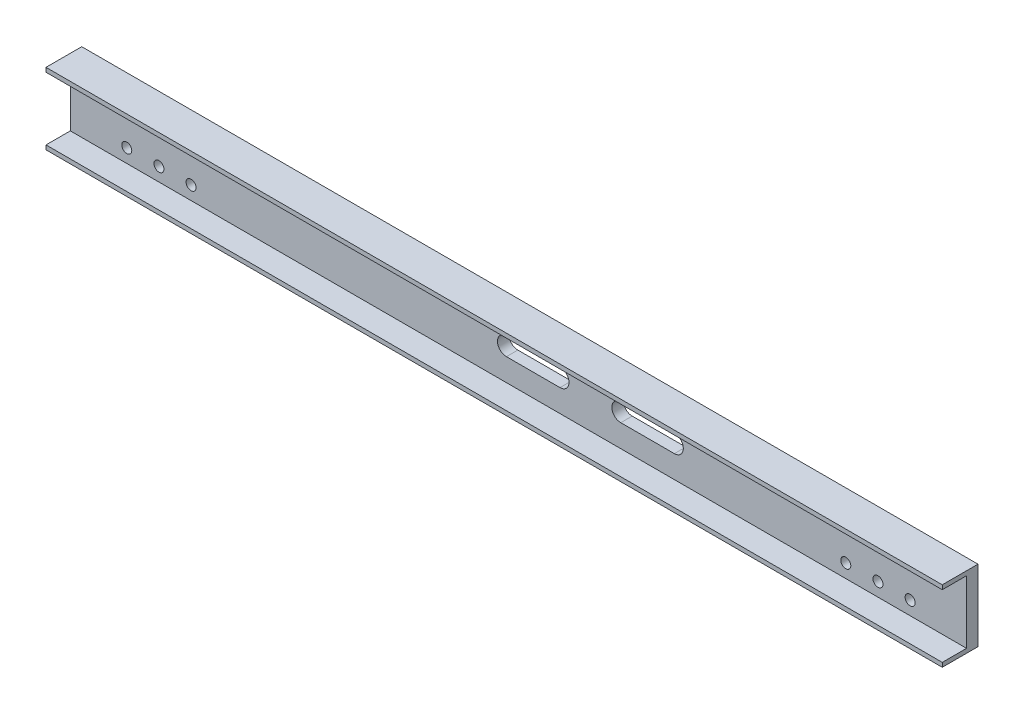
ISO-10303-21;
HEADER;
FILE_DESCRIPTION(('STEP AP214'),'2;1');
FILE_NAME('part.step','',(''),(''),'','','');
FILE_SCHEMA(('AUTOMOTIVE_DESIGN { 1 0 10303 214 1 1 1 1 }'));
ENDSEC;
DATA;
#1=APPLICATION_CONTEXT('core data for automotive mechanical design processes');
#2=APPLICATION_PROTOCOL_DEFINITION('international standard','automotive_design',2000,#1);
#3=PRODUCT_CONTEXT('',#1,'mechanical');
#4=PRODUCT('Part','Part','',(#3));
#5=PRODUCT_RELATED_PRODUCT_CATEGORY('part','',(#4));
#6=PRODUCT_DEFINITION_FORMATION('','',#4);
#7=PRODUCT_DEFINITION_CONTEXT('part definition',#1,'design');
#8=PRODUCT_DEFINITION('design','',#6,#7);
#9=PRODUCT_DEFINITION_SHAPE('','',#8);
#10=(LENGTH_UNIT() NAMED_UNIT(*) SI_UNIT(.MILLI.,.METRE.));
#11=(NAMED_UNIT(*) PLANE_ANGLE_UNIT() SI_UNIT($,.RADIAN.));
#12=(NAMED_UNIT(*) SI_UNIT($,.STERADIAN.) SOLID_ANGLE_UNIT());
#13=UNCERTAINTY_MEASURE_WITH_UNIT(LENGTH_MEASURE(1.E-05),#10,'distance_accuracy_value','');
#14=(GEOMETRIC_REPRESENTATION_CONTEXT(3) GLOBAL_UNCERTAINTY_ASSIGNED_CONTEXT((#13)) GLOBAL_UNIT_ASSIGNED_CONTEXT((#10,
#11,#12)) REPRESENTATION_CONTEXT('',''));
#15=CARTESIAN_POINT('',(0.,0.,0.));
#16=DIRECTION('',(0.,0.,1.));
#17=DIRECTION('',(1.,0.,0.));
#18=AXIS2_PLACEMENT_3D('',#15,#16,#17);
#19=CARTESIAN_POINT('',(1254.,50.,0.));
#20=DIRECTION('',(0.,-1.,0.));
#21=DIRECTION('',(0.,0.,-1.));
#22=AXIS2_PLACEMENT_3D('',#19,#20,#21);
#23=PLANE('',#22);
#24=DIRECTION('',(0.,0.,1.));
#25=VECTOR('',#24,1.);
#26=CARTESIAN_POINT('',(0.,50.,0.));
#27=LINE('',#26,#25);
#28=CARTESIAN_POINT('',(0.,50.,-8.));
#29=VERTEX_POINT('',#28);
#30=CARTESIAN_POINT('',(0.,50.,42.));
#31=VERTEX_POINT('',#30);
#32=EDGE_CURVE('E343',#29,#31,#27,.T.);
#33=ORIENTED_EDGE('',*,*,#32,.T.);
#34=DIRECTION('',(-1.,0.,0.));
#35=VECTOR('',#34,1.);
#36=CARTESIAN_POINT('',(1254.,50.,42.));
#37=LINE('',#36,#35);
#38=CARTESIAN_POINT('',(1254.,50.,42.));
#39=VERTEX_POINT('',#38);
#40=EDGE_CURVE('E11',#39,#31,#37,.T.);
#41=ORIENTED_EDGE('',*,*,#40,.F.);
#42=DIRECTION('',(0.,0.,1.));
#43=VECTOR('',#42,1.);
#44=CARTESIAN_POINT('',(1254.,50.,0.));
#45=LINE('',#44,#43);
#46=CARTESIAN_POINT('',(1254.,50.,-8.));
#47=VERTEX_POINT('',#46);
#48=EDGE_CURVE('E344',#47,#39,#45,.T.);
#49=ORIENTED_EDGE('',*,*,#48,.F.);
#50=DIRECTION('',(-1.,0.,0.));
#51=VECTOR('',#50,1.);
#52=CARTESIAN_POINT('',(1254.,50.,-8.));
#53=LINE('',#52,#51);
#54=EDGE_CURVE('E373',#47,#29,#53,.T.);
#55=ORIENTED_EDGE('',*,*,#54,.T.);
#56=EDGE_LOOP('',(#33,#41,#49,#55));
#57=FACE_BOUND('',#56,.T.);
#58=ADVANCED_FACE('F41',(#57),#23,.F.);
#59=CARTESIAN_POINT('',(1254.,0.,42.));
#60=DIRECTION('',(0.,0.,-1.));
#61=DIRECTION('',(0.,1.,0.));
#62=AXIS2_PLACEMENT_3D('',#59,#60,#61);
#63=PLANE('',#62);
#64=DIRECTION('',(0.,-1.,0.));
#65=VECTOR('',#64,1.);
#66=CARTESIAN_POINT('',(0.,0.,42.));
#67=LINE('',#66,#65);
#68=CARTESIAN_POINT('',(0.,44.,42.));
#69=VERTEX_POINT('',#68);
#70=EDGE_CURVE('E377',#31,#69,#67,.T.);
#71=ORIENTED_EDGE('',*,*,#70,.T.);
#72=DIRECTION('',(-1.,0.,0.));
#73=VECTOR('',#72,1.);
#74=CARTESIAN_POINT('',(1254.,44.,42.));
#75=LINE('',#74,#73);
#76=CARTESIAN_POINT('',(1254.,44.,42.));
#77=VERTEX_POINT('',#76);
#78=EDGE_CURVE('E49',#77,#69,#75,.T.);
#79=ORIENTED_EDGE('',*,*,#78,.F.);
#80=DIRECTION('',(0.,-1.,0.));
#81=VECTOR('',#80,1.);
#82=CARTESIAN_POINT('',(1254.,0.,42.));
#83=LINE('',#82,#81);
#84=EDGE_CURVE('E348',#39,#77,#83,.T.);
#85=ORIENTED_EDGE('',*,*,#84,.F.);
#86=ORIENTED_EDGE('',*,*,#40,.T.);
#87=EDGE_LOOP('',(#71,#79,#85,#86));
#88=FACE_BOUND('',#87,.T.);
#89=ADVANCED_FACE('F427',(#88),#63,.F.);
#90=CARTESIAN_POINT('',(1254.,44.,0.));
#91=DIRECTION('',(0.,-1.,0.));
#92=DIRECTION('',(0.,0.,-1.));
#93=AXIS2_PLACEMENT_3D('',#90,#91,#92);
#94=PLANE('',#93);
#95=DIRECTION('',(0.,0.,1.));
#96=VECTOR('',#95,1.);
#97=CARTESIAN_POINT('',(0.,44.,0.));
#98=LINE('',#97,#96);
#99=CARTESIAN_POINT('',(0.,44.,8.));
#100=VERTEX_POINT('',#99);
#101=EDGE_CURVE('E381',#100,#69,#98,.T.);
#102=ORIENTED_EDGE('',*,*,#101,.F.);
#103=DIRECTION('',(-1.,0.,0.));
#104=VECTOR('',#103,1.);
#105=CARTESIAN_POINT('',(1254.,44.,8.));
#106=LINE('',#105,#104);
#107=CARTESIAN_POINT('',(1254.,44.,8.));
#108=VERTEX_POINT('',#107);
#109=EDGE_CURVE('E418',#108,#100,#106,.T.);
#110=ORIENTED_EDGE('',*,*,#109,.F.);
#111=DIRECTION('',(0.,0.,1.));
#112=VECTOR('',#111,1.);
#113=CARTESIAN_POINT('',(1254.,44.,0.));
#114=LINE('',#113,#112);
#115=EDGE_CURVE('E352',#108,#77,#114,.T.);
#116=ORIENTED_EDGE('',*,*,#115,.T.);
#117=ORIENTED_EDGE('',*,*,#78,.T.);
#118=EDGE_LOOP('',(#102,#110,#116,#117));
#119=FACE_BOUND('',#118,.T.);
#120=ADVANCED_FACE('F424',(#119),#94,.T.);
#121=CARTESIAN_POINT('',(1254.,0.,8.));
#122=DIRECTION('',(0.,0.,1.));
#123=DIRECTION('',(1.,0.,0.));
#124=AXIS2_PLACEMENT_3D('',#121,#122,#123);
#125=PLANE('',#124);
#126=CARTESIAN_POINT('',(770.18,0.,8.));
#127=DIRECTION('',(0.,0.,1.));
#128=DIRECTION('',(1.,0.,0.));
#129=AXIS2_PLACEMENT_3D('',#126,#127,#128);
#130=CIRCLE('',#129,12.5);
#131=CARTESIAN_POINT('',(770.18,12.5,8.));
#132=VERTEX_POINT('',#131);
#133=CARTESIAN_POINT('',(770.18,-12.5,8.));
#134=VERTEX_POINT('',#133);
#135=EDGE_CURVE('E159',#132,#134,#130,.T.);
#136=ORIENTED_EDGE('',*,*,#135,.F.);
#137=DIRECTION('',(-1.,0.,0.));
#138=VECTOR('',#137,1.);
#139=CARTESIAN_POINT('',(1254.,12.5000000000001,8.));
#140=LINE('',#139,#138);
#141=CARTESIAN_POINT('',(845.18,12.5,8.));
#142=VERTEX_POINT('',#141);
#143=EDGE_CURVE('E242',#142,#132,#140,.T.);
#144=ORIENTED_EDGE('',*,*,#143,.F.);
#145=CARTESIAN_POINT('',(845.18,0.,8.));
#146=DIRECTION('',(0.,0.,1.));
#147=DIRECTION('',(1.,0.,0.));
#148=AXIS2_PLACEMENT_3D('',#145,#146,#147);
#149=CIRCLE('',#148,12.5);
#150=CARTESIAN_POINT('',(845.18,-12.5,8.));
#151=VERTEX_POINT('',#150);
#152=EDGE_CURVE('E239',#151,#142,#149,.T.);
#153=ORIENTED_EDGE('',*,*,#152,.F.);
#154=DIRECTION('',(1.,0.,0.));
#155=VECTOR('',#154,1.);
#156=CARTESIAN_POINT('',(1254.,-12.4999999999999,8.));
#157=LINE('',#156,#155);
#158=EDGE_CURVE('E236',#134,#151,#157,.T.);
#159=ORIENTED_EDGE('',*,*,#158,.F.);
#160=EDGE_LOOP('',(#136,#144,#153,#159));
#161=FACE_BOUND('',#160,.T.);
#162=CARTESIAN_POINT('',(685.18,0.,8.));
#163=DIRECTION('',(0.,0.,1.));
#164=DIRECTION('',(1.,0.,0.));
#165=AXIS2_PLACEMENT_3D('',#162,#163,#164);
#166=CIRCLE('',#165,12.5);
#167=CARTESIAN_POINT('',(685.18,-12.5,8.));
#168=VERTEX_POINT('',#167);
#169=CARTESIAN_POINT('',(685.18,12.5,8.));
#170=VERTEX_POINT('',#169);
#171=EDGE_CURVE('E233',#168,#170,#166,.T.);
#172=ORIENTED_EDGE('',*,*,#171,.F.);
#173=DIRECTION('',(1.,0.,0.));
#174=VECTOR('',#173,1.);
#175=CARTESIAN_POINT('',(1254.,-12.4999999999999,8.));
#176=LINE('',#175,#174);
#177=CARTESIAN_POINT('',(610.18,-12.5,8.));
#178=VERTEX_POINT('',#177);
#179=EDGE_CURVE('E230',#178,#168,#176,.T.);
#180=ORIENTED_EDGE('',*,*,#179,.F.);
#181=CARTESIAN_POINT('',(610.18,0.,8.));
#182=DIRECTION('',(0.,0.,1.));
#183=DIRECTION('',(1.,0.,0.));
#184=AXIS2_PLACEMENT_3D('',#181,#182,#183);
#185=CIRCLE('',#184,12.5);
#186=CARTESIAN_POINT('',(610.18,12.5,8.));
#187=VERTEX_POINT('',#186);
#188=EDGE_CURVE('E227',#187,#178,#185,.T.);
#189=ORIENTED_EDGE('',*,*,#188,.F.);
#190=DIRECTION('',(-1.,0.,0.));
#191=VECTOR('',#190,1.);
#192=CARTESIAN_POINT('',(1254.,12.5000000000001,8.));
#193=LINE('',#192,#191);
#194=EDGE_CURVE('E193',#170,#187,#193,.T.);
#195=ORIENTED_EDGE('',*,*,#194,.F.);
#196=EDGE_LOOP('',(#172,#180,#189,#195));
#197=FACE_BOUND('',#196,.T.);
#198=CARTESIAN_POINT('',(1175.,25.,8.));
#199=DIRECTION('',(0.,0.,1.));
#200=DIRECTION('',(1.,0.,0.));
#201=AXIS2_PLACEMENT_3D('',#198,#199,#200);
#202=CIRCLE('',#201,6.9999999999999);
#203=CARTESIAN_POINT('',(1182.,25.,8.));
#204=VERTEX_POINT('',#203);
#205=EDGE_CURVE('E247',#204,#204,#202,.T.);
#206=ORIENTED_EDGE('',*,*,#205,.F.);
#207=EDGE_LOOP('',(#206));
#208=FACE_BOUND('',#207,.T.);
#209=CARTESIAN_POINT('',(1130.,25.,8.));
#210=DIRECTION('',(0.,0.,1.));
#211=DIRECTION('',(1.,0.,0.));
#212=AXIS2_PLACEMENT_3D('',#209,#210,#211);
#213=CIRCLE('',#212,6.9999999999999);
#214=CARTESIAN_POINT('',(1137.,25.,8.));
#215=VERTEX_POINT('',#214);
#216=EDGE_CURVE('E255',#215,#215,#213,.T.);
#217=ORIENTED_EDGE('',*,*,#216,.F.);
#218=EDGE_LOOP('',(#217));
#219=FACE_BOUND('',#218,.T.);
#220=CARTESIAN_POINT('',(1085.,25.,8.));
#221=DIRECTION('',(0.,0.,1.));
#222=DIRECTION('',(1.,0.,0.));
#223=AXIS2_PLACEMENT_3D('',#220,#221,#222);
#224=CIRCLE('',#223,6.9999999999999);
#225=CARTESIAN_POINT('',(1092.,25.,8.));
#226=VERTEX_POINT('',#225);
#227=EDGE_CURVE('E263',#226,#226,#224,.T.);
#228=ORIENTED_EDGE('',*,*,#227,.F.);
#229=EDGE_LOOP('',(#228));
#230=FACE_BOUND('',#229,.T.);
#231=CARTESIAN_POINT('',(1085.,-25.,8.));
#232=DIRECTION('',(0.,0.,1.));
#233=DIRECTION('',(1.,0.,0.));
#234=AXIS2_PLACEMENT_3D('',#231,#232,#233);
#235=CIRCLE('',#234,6.9999999999999);
#236=CARTESIAN_POINT('',(1092.,-25.,8.));
#237=VERTEX_POINT('',#236);
#238=EDGE_CURVE('E271',#237,#237,#235,.T.);
#239=ORIENTED_EDGE('',*,*,#238,.F.);
#240=EDGE_LOOP('',(#239));
#241=FACE_BOUND('',#240,.T.);
#242=CARTESIAN_POINT('',(1130.,-25.,8.));
#243=DIRECTION('',(0.,0.,1.));
#244=DIRECTION('',(1.,0.,0.));
#245=AXIS2_PLACEMENT_3D('',#242,#243,#244);
#246=CIRCLE('',#245,6.9999999999999);
#247=CARTESIAN_POINT('',(1137.,-25.,8.));
#248=VERTEX_POINT('',#247);
#249=EDGE_CURVE('E279',#248,#248,#246,.T.);
#250=ORIENTED_EDGE('',*,*,#249,.F.);
#251=EDGE_LOOP('',(#250));
#252=FACE_BOUND('',#251,.T.);
#253=CARTESIAN_POINT('',(1175.,-25.,8.));
#254=DIRECTION('',(0.,0.,1.));
#255=DIRECTION('',(1.,0.,0.));
#256=AXIS2_PLACEMENT_3D('',#253,#254,#255);
#257=CIRCLE('',#256,6.9999999999999);
#258=CARTESIAN_POINT('',(1182.,-25.,8.));
#259=VERTEX_POINT('',#258);
#260=EDGE_CURVE('E287',#259,#259,#257,.T.);
#261=ORIENTED_EDGE('',*,*,#260,.F.);
#262=EDGE_LOOP('',(#261));
#263=FACE_BOUND('',#262,.T.);
#264=CARTESIAN_POINT('',(79.,25.,8.));
#265=DIRECTION('',(0.,0.,1.));
#266=DIRECTION('',(1.,0.,0.));
#267=AXIS2_PLACEMENT_3D('',#264,#265,#266);
#268=CIRCLE('',#267,6.99999999999999);
#269=CARTESIAN_POINT('',(86.,25.,8.));
#270=VERTEX_POINT('',#269);
#271=EDGE_CURVE('E295',#270,#270,#268,.T.);
#272=ORIENTED_EDGE('',*,*,#271,.F.);
#273=EDGE_LOOP('',(#272));
#274=FACE_BOUND('',#273,.T.);
#275=CARTESIAN_POINT('',(124.,25.,8.));
#276=DIRECTION('',(0.,0.,1.));
#277=DIRECTION('',(1.,0.,0.));
#278=AXIS2_PLACEMENT_3D('',#275,#276,#277);
#279=CIRCLE('',#278,7.00000000000001);
#280=CARTESIAN_POINT('',(131.,25.,8.));
#281=VERTEX_POINT('',#280);
#282=EDGE_CURVE('E303',#281,#281,#279,.T.);
#283=ORIENTED_EDGE('',*,*,#282,.F.);
#284=EDGE_LOOP('',(#283));
#285=FACE_BOUND('',#284,.T.);
#286=CARTESIAN_POINT('',(169.,25.,8.));
#287=DIRECTION('',(0.,0.,1.));
#288=DIRECTION('',(1.,0.,0.));
#289=AXIS2_PLACEMENT_3D('',#286,#287,#288);
#290=CIRCLE('',#289,7.00000000000001);
#291=CARTESIAN_POINT('',(176.,25.,8.));
#292=VERTEX_POINT('',#291);
#293=EDGE_CURVE('E311',#292,#292,#290,.T.);
#294=ORIENTED_EDGE('',*,*,#293,.F.);
#295=EDGE_LOOP('',(#294));
#296=FACE_BOUND('',#295,.T.);
#297=CARTESIAN_POINT('',(169.,-25.,8.));
#298=DIRECTION('',(0.,0.,1.));
#299=DIRECTION('',(1.,0.,0.));
#300=AXIS2_PLACEMENT_3D('',#297,#298,#299);
#301=CIRCLE('',#300,7.00000000000001);
#302=CARTESIAN_POINT('',(176.,-25.,8.));
#303=VERTEX_POINT('',#302);
#304=EDGE_CURVE('E319',#303,#303,#301,.T.);
#305=ORIENTED_EDGE('',*,*,#304,.F.);
#306=EDGE_LOOP('',(#305));
#307=FACE_BOUND('',#306,.T.);
#308=CARTESIAN_POINT('',(124.,-25.,8.));
#309=DIRECTION('',(0.,0.,1.));
#310=DIRECTION('',(1.,0.,0.));
#311=AXIS2_PLACEMENT_3D('',#308,#309,#310);
#312=CIRCLE('',#311,7.00000000000001);
#313=CARTESIAN_POINT('',(131.,-25.,8.));
#314=VERTEX_POINT('',#313);
#315=EDGE_CURVE('E327',#314,#314,#312,.T.);
#316=ORIENTED_EDGE('',*,*,#315,.F.);
#317=EDGE_LOOP('',(#316));
#318=FACE_BOUND('',#317,.T.);
#319=CARTESIAN_POINT('',(79.,-25.,8.));
#320=DIRECTION('',(0.,0.,1.));
#321=DIRECTION('',(1.,0.,0.));
#322=AXIS2_PLACEMENT_3D('',#319,#320,#321);
#323=CIRCLE('',#322,6.99999999999999);
#324=CARTESIAN_POINT('',(86.,-25.,8.));
#325=VERTEX_POINT('',#324);
#326=EDGE_CURVE('E335',#325,#325,#323,.T.);
#327=ORIENTED_EDGE('',*,*,#326,.F.);
#328=EDGE_LOOP('',(#327));
#329=FACE_BOUND('',#328,.T.);
#330=DIRECTION('',(0.,1.,0.));
#331=VECTOR('',#330,1.);
#332=CARTESIAN_POINT('',(0.,0.,8.));
#333=LINE('',#332,#331);
#334=CARTESIAN_POINT('',(0.,-44.,8.));
#335=VERTEX_POINT('',#334);
#336=EDGE_CURVE('E385',#335,#100,#333,.T.);
#337=ORIENTED_EDGE('',*,*,#336,.F.);
#338=DIRECTION('',(-1.,0.,0.));
#339=VECTOR('',#338,1.);
#340=CARTESIAN_POINT('',(1254.,-44.,8.));
#341=LINE('',#340,#339);
#342=CARTESIAN_POINT('',(1254.,-44.,8.));
#343=VERTEX_POINT('',#342);
#344=EDGE_CURVE('E415',#343,#335,#341,.T.);
#345=ORIENTED_EDGE('',*,*,#344,.F.);
#346=DIRECTION('',(0.,1.,0.));
#347=VECTOR('',#346,1.);
#348=CARTESIAN_POINT('',(1254.,0.,8.));
#349=LINE('',#348,#347);
#350=EDGE_CURVE('E356',#343,#108,#349,.T.);
#351=ORIENTED_EDGE('',*,*,#350,.T.);
#352=ORIENTED_EDGE('',*,*,#109,.T.);
#353=EDGE_LOOP('',(#337,#345,#351,#352));
#354=FACE_BOUND('',#353,.T.);
#355=ADVANCED_FACE('F435',(#161,#197,#208,#219,#230,#241,#252,#263,#274,#285,#296,#307,#318,
#329,#354),#125,.T.);
#356=CARTESIAN_POINT('',(1254.,-44.,0.));
#357=DIRECTION('',(0.,-1.,0.));
#358=DIRECTION('',(0.,0.,-1.));
#359=AXIS2_PLACEMENT_3D('',#356,#357,#358);
#360=PLANE('',#359);
#361=DIRECTION('',(0.,0.,1.));
#362=VECTOR('',#361,1.);
#363=CARTESIAN_POINT('',(0.,-44.,0.));
#364=LINE('',#363,#362);
#365=CARTESIAN_POINT('',(0.,-44.,42.));
#366=VERTEX_POINT('',#365);
#367=EDGE_CURVE('E389',#335,#366,#364,.T.);
#368=ORIENTED_EDGE('',*,*,#367,.T.);
#369=DIRECTION('',(-1.,0.,0.));
#370=VECTOR('',#369,1.);
#371=CARTESIAN_POINT('',(1254.,-44.,42.));
#372=LINE('',#371,#370);
#373=CARTESIAN_POINT('',(1254.,-44.,42.));
#374=VERTEX_POINT('',#373);
#375=EDGE_CURVE('E412',#374,#366,#372,.T.);
#376=ORIENTED_EDGE('',*,*,#375,.F.);
#377=DIRECTION('',(0.,0.,1.));
#378=VECTOR('',#377,1.);
#379=CARTESIAN_POINT('',(1254.,-44.,0.));
#380=LINE('',#379,#378);
#381=EDGE_CURVE('E360',#343,#374,#380,.T.);
#382=ORIENTED_EDGE('',*,*,#381,.F.);
#383=ORIENTED_EDGE('',*,*,#344,.T.);
#384=EDGE_LOOP('',(#368,#376,#382,#383));
#385=FACE_BOUND('',#384,.T.);
#386=ADVANCED_FACE('F457',(#385),#360,.F.);
#387=CARTESIAN_POINT('',(1254.,0.,42.));
#388=DIRECTION('',(0.,0.,1.));
#389=DIRECTION('',(0.,-1.,0.));
#390=AXIS2_PLACEMENT_3D('',#387,#388,#389);
#391=PLANE('',#390);
#392=DIRECTION('',(0.,1.,0.));
#393=VECTOR('',#392,1.);
#394=CARTESIAN_POINT('',(0.,0.,42.));
#395=LINE('',#394,#393);
#396=CARTESIAN_POINT('',(0.,-50.,42.));
#397=VERTEX_POINT('',#396);
#398=EDGE_CURVE('E393',#397,#366,#395,.T.);
#399=ORIENTED_EDGE('',*,*,#398,.F.);
#400=DIRECTION('',(-1.,0.,0.));
#401=VECTOR('',#400,1.);
#402=CARTESIAN_POINT('',(1254.,-50.,42.));
#403=LINE('',#402,#401);
#404=CARTESIAN_POINT('',(1254.,-50.,42.));
#405=VERTEX_POINT('',#404);
#406=EDGE_CURVE('E409',#405,#397,#403,.T.);
#407=ORIENTED_EDGE('',*,*,#406,.F.);
#408=DIRECTION('',(0.,1.,0.));
#409=VECTOR('',#408,1.);
#410=CARTESIAN_POINT('',(1254.,0.,42.));
#411=LINE('',#410,#409);
#412=EDGE_CURVE('E363',#405,#374,#411,.T.);
#413=ORIENTED_EDGE('',*,*,#412,.T.);
#414=ORIENTED_EDGE('',*,*,#375,.T.);
#415=EDGE_LOOP('',(#399,#407,#413,#414));
#416=FACE_BOUND('',#415,.T.);
#417=ADVANCED_FACE('F454',(#416),#391,.T.);
#418=CARTESIAN_POINT('',(1254.,-50.,0.));
#419=DIRECTION('',(0.,1.,0.));
#420=DIRECTION('',(0.,0.,1.));
#421=AXIS2_PLACEMENT_3D('',#418,#419,#420);
#422=PLANE('',#421);
#423=DIRECTION('',(0.,0.,-1.));
#424=VECTOR('',#423,1.);
#425=CARTESIAN_POINT('',(0.,-50.,0.));
#426=LINE('',#425,#424);
#427=CARTESIAN_POINT('',(0.,-50.,-8.));
#428=VERTEX_POINT('',#427);
#429=EDGE_CURVE('E397',#397,#428,#426,.T.);
#430=ORIENTED_EDGE('',*,*,#429,.T.);
#431=DIRECTION('',(-1.,0.,0.));
#432=VECTOR('',#431,1.);
#433=CARTESIAN_POINT('',(1254.,-50.,-8.));
#434=LINE('',#433,#432);
#435=CARTESIAN_POINT('',(1254.,-50.,-8.));
#436=VERTEX_POINT('',#435);
#437=EDGE_CURVE('E405',#436,#428,#434,.T.);
#438=ORIENTED_EDGE('',*,*,#437,.F.);
#439=DIRECTION('',(0.,0.,-1.));
#440=VECTOR('',#439,1.);
#441=CARTESIAN_POINT('',(1254.,-50.,0.));
#442=LINE('',#441,#440);
#443=EDGE_CURVE('E367',#405,#436,#442,.T.);
#444=ORIENTED_EDGE('',*,*,#443,.F.);
#445=ORIENTED_EDGE('',*,*,#406,.T.);
#446=EDGE_LOOP('',(#430,#438,#444,#445));
#447=FACE_BOUND('',#446,.T.);
#448=ADVANCED_FACE('F451',(#447),#422,.F.);
#449=CARTESIAN_POINT('',(1254.,0.,-8.));
#450=DIRECTION('',(0.,0.,1.));
#451=DIRECTION('',(0.,-1.,0.));
#452=AXIS2_PLACEMENT_3D('',#449,#450,#451);
#453=PLANE('',#452);
#454=DIRECTION('',(-1.,0.,0.));
#455=VECTOR('',#454,1.);
#456=CARTESIAN_POINT('',(770.18,12.5,-8.));
#457=LINE('',#456,#455);
#458=CARTESIAN_POINT('',(845.18,12.5,-8.));
#459=VERTEX_POINT('',#458);
#460=CARTESIAN_POINT('',(770.18,12.5,-8.));
#461=VERTEX_POINT('',#460);
#462=EDGE_CURVE('E163',#459,#461,#457,.T.);
#463=ORIENTED_EDGE('',*,*,#462,.T.);
#464=CARTESIAN_POINT('',(770.18,0.,-8.));
#465=DIRECTION('',(0.,0.,1.));
#466=DIRECTION('',(1.,0.,0.));
#467=AXIS2_PLACEMENT_3D('',#464,#465,#466);
#468=CIRCLE('',#467,12.5);
#469=CARTESIAN_POINT('',(770.18,-12.5,-8.));
#470=VERTEX_POINT('',#469);
#471=EDGE_CURVE('E156',#461,#470,#468,.T.);
#472=ORIENTED_EDGE('',*,*,#471,.T.);
#473=DIRECTION('',(1.,0.,0.));
#474=VECTOR('',#473,1.);
#475=CARTESIAN_POINT('',(770.18,-12.5,-8.));
#476=LINE('',#475,#474);
#477=CARTESIAN_POINT('',(845.18,-12.5,-8.));
#478=VERTEX_POINT('',#477);
#479=EDGE_CURVE('E167',#470,#478,#476,.T.);
#480=ORIENTED_EDGE('',*,*,#479,.T.);
#481=CARTESIAN_POINT('',(845.18,0.,-8.));
#482=DIRECTION('',(0.,0.,1.));
#483=DIRECTION('',(1.,0.,0.));
#484=AXIS2_PLACEMENT_3D('',#481,#482,#483);
#485=CIRCLE('',#484,12.5);
#486=EDGE_CURVE('E173',#478,#459,#485,.T.);
#487=ORIENTED_EDGE('',*,*,#486,.T.);
#488=EDGE_LOOP('',(#463,#472,#480,#487));
#489=FACE_BOUND('',#488,.T.);
#490=DIRECTION('',(1.,0.,0.));
#491=VECTOR('',#490,1.);
#492=CARTESIAN_POINT('',(685.18,-12.5,-8.));
#493=LINE('',#492,#491);
#494=CARTESIAN_POINT('',(610.18,-12.5,-8.));
#495=VERTEX_POINT('',#494);
#496=CARTESIAN_POINT('',(685.18,-12.5,-8.));
#497=VERTEX_POINT('',#496);
#498=EDGE_CURVE('E212',#495,#497,#493,.T.);
#499=ORIENTED_EDGE('',*,*,#498,.T.);
#500=CARTESIAN_POINT('',(685.18,0.,-8.));
#501=DIRECTION('',(0.,0.,1.));
#502=DIRECTION('',(1.,0.,0.));
#503=AXIS2_PLACEMENT_3D('',#500,#501,#502);
#504=CIRCLE('',#503,12.5);
#505=CARTESIAN_POINT('',(685.18,12.5,-8.));
#506=VERTEX_POINT('',#505);
#507=EDGE_CURVE('E200',#497,#506,#504,.T.);
#508=ORIENTED_EDGE('',*,*,#507,.T.);
#509=DIRECTION('',(-1.,0.,0.));
#510=VECTOR('',#509,1.);
#511=CARTESIAN_POINT('',(685.18,12.5,-8.));
#512=LINE('',#511,#510);
#513=CARTESIAN_POINT('',(610.18,12.5,-8.));
#514=VERTEX_POINT('',#513);
#515=EDGE_CURVE('E204',#506,#514,#512,.T.);
#516=ORIENTED_EDGE('',*,*,#515,.T.);
#517=CARTESIAN_POINT('',(610.18,0.,-8.));
#518=DIRECTION('',(0.,0.,1.));
#519=DIRECTION('',(1.,0.,0.));
#520=AXIS2_PLACEMENT_3D('',#517,#518,#519);
#521=CIRCLE('',#520,12.5);
#522=EDGE_CURVE('E208',#514,#495,#521,.T.);
#523=ORIENTED_EDGE('',*,*,#522,.T.);
#524=EDGE_LOOP('',(#499,#508,#516,#523));
#525=FACE_BOUND('',#524,.T.);
#526=CARTESIAN_POINT('',(1175.,25.,-8.));
#527=DIRECTION('',(0.,0.,1.));
#528=DIRECTION('',(1.,0.,0.));
#529=AXIS2_PLACEMENT_3D('',#526,#527,#528);
#530=CIRCLE('',#529,6.9999999999999);
#531=CARTESIAN_POINT('',(1182.,25.,-8.));
#532=VERTEX_POINT('',#531);
#533=EDGE_CURVE('E251',#532,#532,#530,.T.);
#534=ORIENTED_EDGE('',*,*,#533,.T.);
#535=EDGE_LOOP('',(#534));
#536=FACE_BOUND('',#535,.T.);
#537=CARTESIAN_POINT('',(1130.,25.,-8.));
#538=DIRECTION('',(0.,0.,1.));
#539=DIRECTION('',(1.,0.,0.));
#540=AXIS2_PLACEMENT_3D('',#537,#538,#539);
#541=CIRCLE('',#540,6.9999999999999);
#542=CARTESIAN_POINT('',(1137.,25.,-8.));
#543=VERTEX_POINT('',#542);
#544=EDGE_CURVE('E259',#543,#543,#541,.T.);
#545=ORIENTED_EDGE('',*,*,#544,.T.);
#546=EDGE_LOOP('',(#545));
#547=FACE_BOUND('',#546,.T.);
#548=CARTESIAN_POINT('',(1085.,25.,-8.));
#549=DIRECTION('',(0.,0.,1.));
#550=DIRECTION('',(1.,0.,0.));
#551=AXIS2_PLACEMENT_3D('',#548,#549,#550);
#552=CIRCLE('',#551,6.9999999999999);
#553=CARTESIAN_POINT('',(1092.,25.,-8.));
#554=VERTEX_POINT('',#553);
#555=EDGE_CURVE('E267',#554,#554,#552,.T.);
#556=ORIENTED_EDGE('',*,*,#555,.T.);
#557=EDGE_LOOP('',(#556));
#558=FACE_BOUND('',#557,.T.);
#559=CARTESIAN_POINT('',(1085.,-25.,-8.));
#560=DIRECTION('',(0.,0.,1.));
#561=DIRECTION('',(1.,0.,0.));
#562=AXIS2_PLACEMENT_3D('',#559,#560,#561);
#563=CIRCLE('',#562,6.9999999999999);
#564=CARTESIAN_POINT('',(1092.,-25.,-8.));
#565=VERTEX_POINT('',#564);
#566=EDGE_CURVE('E275',#565,#565,#563,.T.);
#567=ORIENTED_EDGE('',*,*,#566,.T.);
#568=EDGE_LOOP('',(#567));
#569=FACE_BOUND('',#568,.T.);
#570=CARTESIAN_POINT('',(1130.,-25.,-8.));
#571=DIRECTION('',(0.,0.,1.));
#572=DIRECTION('',(1.,0.,0.));
#573=AXIS2_PLACEMENT_3D('',#570,#571,#572);
#574=CIRCLE('',#573,6.9999999999999);
#575=CARTESIAN_POINT('',(1137.,-25.,-8.));
#576=VERTEX_POINT('',#575);
#577=EDGE_CURVE('E283',#576,#576,#574,.T.);
#578=ORIENTED_EDGE('',*,*,#577,.T.);
#579=EDGE_LOOP('',(#578));
#580=FACE_BOUND('',#579,.T.);
#581=CARTESIAN_POINT('',(1175.,-25.,-8.));
#582=DIRECTION('',(0.,0.,1.));
#583=DIRECTION('',(1.,0.,0.));
#584=AXIS2_PLACEMENT_3D('',#581,#582,#583);
#585=CIRCLE('',#584,6.9999999999999);
#586=CARTESIAN_POINT('',(1182.,-25.,-8.));
#587=VERTEX_POINT('',#586);
#588=EDGE_CURVE('E291',#587,#587,#585,.T.);
#589=ORIENTED_EDGE('',*,*,#588,.T.);
#590=EDGE_LOOP('',(#589));
#591=FACE_BOUND('',#590,.T.);
#592=CARTESIAN_POINT('',(79.,25.,-8.));
#593=DIRECTION('',(0.,0.,1.));
#594=DIRECTION('',(1.,0.,0.));
#595=AXIS2_PLACEMENT_3D('',#592,#593,#594);
#596=CIRCLE('',#595,6.99999999999999);
#597=CARTESIAN_POINT('',(86.,25.,-8.));
#598=VERTEX_POINT('',#597);
#599=EDGE_CURVE('E299',#598,#598,#596,.T.);
#600=ORIENTED_EDGE('',*,*,#599,.T.);
#601=EDGE_LOOP('',(#600));
#602=FACE_BOUND('',#601,.T.);
#603=CARTESIAN_POINT('',(124.,25.,-8.));
#604=DIRECTION('',(0.,0.,1.));
#605=DIRECTION('',(1.,0.,0.));
#606=AXIS2_PLACEMENT_3D('',#603,#604,#605);
#607=CIRCLE('',#606,7.00000000000001);
#608=CARTESIAN_POINT('',(131.,25.,-8.));
#609=VERTEX_POINT('',#608);
#610=EDGE_CURVE('E307',#609,#609,#607,.T.);
#611=ORIENTED_EDGE('',*,*,#610,.T.);
#612=EDGE_LOOP('',(#611));
#613=FACE_BOUND('',#612,.T.);
#614=CARTESIAN_POINT('',(169.,25.,-8.));
#615=DIRECTION('',(0.,0.,1.));
#616=DIRECTION('',(1.,0.,0.));
#617=AXIS2_PLACEMENT_3D('',#614,#615,#616);
#618=CIRCLE('',#617,7.00000000000001);
#619=CARTESIAN_POINT('',(176.,25.,-8.));
#620=VERTEX_POINT('',#619);
#621=EDGE_CURVE('E315',#620,#620,#618,.T.);
#622=ORIENTED_EDGE('',*,*,#621,.T.);
#623=EDGE_LOOP('',(#622));
#624=FACE_BOUND('',#623,.T.);
#625=CARTESIAN_POINT('',(169.,-25.,-8.));
#626=DIRECTION('',(0.,0.,1.));
#627=DIRECTION('',(1.,0.,0.));
#628=AXIS2_PLACEMENT_3D('',#625,#626,#627);
#629=CIRCLE('',#628,7.00000000000001);
#630=CARTESIAN_POINT('',(176.,-25.,-8.));
#631=VERTEX_POINT('',#630);
#632=EDGE_CURVE('E323',#631,#631,#629,.T.);
#633=ORIENTED_EDGE('',*,*,#632,.T.);
#634=EDGE_LOOP('',(#633));
#635=FACE_BOUND('',#634,.T.);
#636=CARTESIAN_POINT('',(124.,-25.,-8.));
#637=DIRECTION('',(0.,0.,1.));
#638=DIRECTION('',(1.,0.,0.));
#639=AXIS2_PLACEMENT_3D('',#636,#637,#638);
#640=CIRCLE('',#639,7.00000000000001);
#641=CARTESIAN_POINT('',(131.,-25.,-8.));
#642=VERTEX_POINT('',#641);
#643=EDGE_CURVE('E331',#642,#642,#640,.T.);
#644=ORIENTED_EDGE('',*,*,#643,.T.);
#645=EDGE_LOOP('',(#644));
#646=FACE_BOUND('',#645,.T.);
#647=CARTESIAN_POINT('',(79.,-25.,-8.));
#648=DIRECTION('',(0.,0.,1.));
#649=DIRECTION('',(1.,0.,0.));
#650=AXIS2_PLACEMENT_3D('',#647,#648,#649);
#651=CIRCLE('',#650,6.99999999999999);
#652=CARTESIAN_POINT('',(86.,-25.,-8.));
#653=VERTEX_POINT('',#652);
#654=EDGE_CURVE('E339',#653,#653,#651,.T.);
#655=ORIENTED_EDGE('',*,*,#654,.T.);
#656=EDGE_LOOP('',(#655));
#657=FACE_BOUND('',#656,.T.);
#658=DIRECTION('',(0.,1.,0.));
#659=VECTOR('',#658,1.);
#660=CARTESIAN_POINT('',(0.,0.,-8.));
#661=LINE('',#660,#659);
#662=EDGE_CURVE('E349',#428,#29,#661,.T.);
#663=ORIENTED_EDGE('',*,*,#662,.T.);
#664=ORIENTED_EDGE('',*,*,#54,.F.);
#665=DIRECTION('',(0.,1.,0.));
#666=VECTOR('',#665,1.);
#667=CARTESIAN_POINT('',(1254.,0.,-8.));
#668=LINE('',#667,#666);
#669=EDGE_CURVE('E370',#436,#47,#668,.T.);
#670=ORIENTED_EDGE('',*,*,#669,.F.);
#671=ORIENTED_EDGE('',*,*,#437,.T.);
#672=EDGE_LOOP('',(#663,#664,#670,#671));
#673=FACE_BOUND('',#672,.T.);
#674=ADVANCED_FACE('F175',(#489,#525,#536,#547,#558,#569,#580,#591,#602,#613,#624,#635,#646,
#657,#673),#453,.F.);
#675=CARTESIAN_POINT('',(1254.,0.,0.));
#676=DIRECTION('',(1.,0.,0.));
#677=DIRECTION('',(0.,0.,-1.));
#678=AXIS2_PLACEMENT_3D('',#675,#676,#677);
#679=PLANE('',#678);
#680=ORIENTED_EDGE('',*,*,#48,.T.);
#681=ORIENTED_EDGE('',*,*,#84,.T.);
#682=ORIENTED_EDGE('',*,*,#115,.F.);
#683=ORIENTED_EDGE('',*,*,#350,.F.);
#684=ORIENTED_EDGE('',*,*,#381,.T.);
#685=ORIENTED_EDGE('',*,*,#412,.F.);
#686=ORIENTED_EDGE('',*,*,#443,.T.);
#687=ORIENTED_EDGE('',*,*,#669,.T.);
#688=EDGE_LOOP('',(#680,#681,#682,#683,#684,#685,#686,#687));
#689=FACE_BOUND('',#688,.T.);
#690=ADVANCED_FACE('F439',(#689),#679,.T.);
#691=CARTESIAN_POINT('',(0.,0.,0.));
#692=DIRECTION('',(1.,0.,0.));
#693=DIRECTION('',(0.,0.,-1.));
#694=AXIS2_PLACEMENT_3D('',#691,#692,#693);
#695=PLANE('',#694);
#696=ORIENTED_EDGE('',*,*,#32,.F.);
#697=ORIENTED_EDGE('',*,*,#662,.F.);
#698=ORIENTED_EDGE('',*,*,#429,.F.);
#699=ORIENTED_EDGE('',*,*,#398,.T.);
#700=ORIENTED_EDGE('',*,*,#367,.F.);
#701=ORIENTED_EDGE('',*,*,#336,.T.);
#702=ORIENTED_EDGE('',*,*,#101,.T.);
#703=ORIENTED_EDGE('',*,*,#70,.F.);
#704=EDGE_LOOP('',(#696,#697,#698,#699,#700,#701,#702,#703));
#705=FACE_BOUND('',#704,.T.);
#706=ADVANCED_FACE('F431',(#705),#695,.F.);
#707=CARTESIAN_POINT('',(79.,-25.,8.));
#708=DIRECTION('',(0.,0.,1.));
#709=DIRECTION('',(1.,0.,0.));
#710=AXIS2_PLACEMENT_3D('',#707,#708,#709);
#711=CYLINDRICAL_SURFACE('',#710,6.99999999999999);
#712=ORIENTED_EDGE('',*,*,#654,.F.);
#713=EDGE_LOOP('',(#712));
#714=FACE_BOUND('',#713,.T.);
#715=ORIENTED_EDGE('',*,*,#326,.T.);
#716=EDGE_LOOP('',(#715));
#717=FACE_BOUND('',#716,.T.);
#718=ADVANCED_FACE('F621',(#714,#717),#711,.F.);
#719=CARTESIAN_POINT('',(124.,-25.,8.));
#720=DIRECTION('',(0.,0.,1.));
#721=DIRECTION('',(1.,0.,0.));
#722=AXIS2_PLACEMENT_3D('',#719,#720,#721);
#723=CYLINDRICAL_SURFACE('',#722,7.00000000000001);
#724=ORIENTED_EDGE('',*,*,#643,.F.);
#725=EDGE_LOOP('',(#724));
#726=FACE_BOUND('',#725,.T.);
#727=ORIENTED_EDGE('',*,*,#315,.T.);
#728=EDGE_LOOP('',(#727));
#729=FACE_BOUND('',#728,.T.);
#730=ADVANCED_FACE('F617',(#726,#729),#723,.F.);
#731=CARTESIAN_POINT('',(169.,-25.,8.));
#732=DIRECTION('',(0.,0.,1.));
#733=DIRECTION('',(1.,0.,0.));
#734=AXIS2_PLACEMENT_3D('',#731,#732,#733);
#735=CYLINDRICAL_SURFACE('',#734,7.00000000000001);
#736=ORIENTED_EDGE('',*,*,#632,.F.);
#737=EDGE_LOOP('',(#736));
#738=FACE_BOUND('',#737,.T.);
#739=ORIENTED_EDGE('',*,*,#304,.T.);
#740=EDGE_LOOP('',(#739));
#741=FACE_BOUND('',#740,.T.);
#742=ADVANCED_FACE('F613',(#738,#741),#735,.F.);
#743=CARTESIAN_POINT('',(169.,25.,8.));
#744=DIRECTION('',(0.,0.,1.));
#745=DIRECTION('',(1.,0.,0.));
#746=AXIS2_PLACEMENT_3D('',#743,#744,#745);
#747=CYLINDRICAL_SURFACE('',#746,7.00000000000001);
#748=ORIENTED_EDGE('',*,*,#621,.F.);
#749=EDGE_LOOP('',(#748));
#750=FACE_BOUND('',#749,.T.);
#751=ORIENTED_EDGE('',*,*,#293,.T.);
#752=EDGE_LOOP('',(#751));
#753=FACE_BOUND('',#752,.T.);
#754=ADVANCED_FACE('F609',(#750,#753),#747,.F.);
#755=CARTESIAN_POINT('',(124.,25.,8.));
#756=DIRECTION('',(0.,0.,1.));
#757=DIRECTION('',(1.,0.,0.));
#758=AXIS2_PLACEMENT_3D('',#755,#756,#757);
#759=CYLINDRICAL_SURFACE('',#758,7.00000000000001);
#760=ORIENTED_EDGE('',*,*,#610,.F.);
#761=EDGE_LOOP('',(#760));
#762=FACE_BOUND('',#761,.T.);
#763=ORIENTED_EDGE('',*,*,#282,.T.);
#764=EDGE_LOOP('',(#763));
#765=FACE_BOUND('',#764,.T.);
#766=ADVANCED_FACE('F605',(#762,#765),#759,.F.);
#767=CARTESIAN_POINT('',(79.,25.,8.));
#768=DIRECTION('',(0.,0.,1.));
#769=DIRECTION('',(1.,0.,0.));
#770=AXIS2_PLACEMENT_3D('',#767,#768,#769);
#771=CYLINDRICAL_SURFACE('',#770,6.99999999999999);
#772=ORIENTED_EDGE('',*,*,#599,.F.);
#773=EDGE_LOOP('',(#772));
#774=FACE_BOUND('',#773,.T.);
#775=ORIENTED_EDGE('',*,*,#271,.T.);
#776=EDGE_LOOP('',(#775));
#777=FACE_BOUND('',#776,.T.);
#778=ADVANCED_FACE('F601',(#774,#777),#771,.F.);
#779=CARTESIAN_POINT('',(1175.,-25.,8.));
#780=DIRECTION('',(0.,0.,1.));
#781=DIRECTION('',(1.,0.,0.));
#782=AXIS2_PLACEMENT_3D('',#779,#780,#781);
#783=CYLINDRICAL_SURFACE('',#782,6.9999999999999);
#784=ORIENTED_EDGE('',*,*,#588,.F.);
#785=EDGE_LOOP('',(#784));
#786=FACE_BOUND('',#785,.T.);
#787=ORIENTED_EDGE('',*,*,#260,.T.);
#788=EDGE_LOOP('',(#787));
#789=FACE_BOUND('',#788,.T.);
#790=ADVANCED_FACE('F597',(#786,#789),#783,.F.);
#791=CARTESIAN_POINT('',(1130.,-25.,8.));
#792=DIRECTION('',(0.,0.,1.));
#793=DIRECTION('',(1.,0.,0.));
#794=AXIS2_PLACEMENT_3D('',#791,#792,#793);
#795=CYLINDRICAL_SURFACE('',#794,6.9999999999999);
#796=ORIENTED_EDGE('',*,*,#577,.F.);
#797=EDGE_LOOP('',(#796));
#798=FACE_BOUND('',#797,.T.);
#799=ORIENTED_EDGE('',*,*,#249,.T.);
#800=EDGE_LOOP('',(#799));
#801=FACE_BOUND('',#800,.T.);
#802=ADVANCED_FACE('F593',(#798,#801),#795,.F.);
#803=CARTESIAN_POINT('',(1085.,-25.,8.));
#804=DIRECTION('',(0.,0.,1.));
#805=DIRECTION('',(1.,0.,0.));
#806=AXIS2_PLACEMENT_3D('',#803,#804,#805);
#807=CYLINDRICAL_SURFACE('',#806,6.9999999999999);
#808=ORIENTED_EDGE('',*,*,#566,.F.);
#809=EDGE_LOOP('',(#808));
#810=FACE_BOUND('',#809,.T.);
#811=ORIENTED_EDGE('',*,*,#238,.T.);
#812=EDGE_LOOP('',(#811));
#813=FACE_BOUND('',#812,.T.);
#814=ADVANCED_FACE('F589',(#810,#813),#807,.F.);
#815=CARTESIAN_POINT('',(1085.,25.,8.));
#816=DIRECTION('',(0.,0.,1.));
#817=DIRECTION('',(1.,0.,0.));
#818=AXIS2_PLACEMENT_3D('',#815,#816,#817);
#819=CYLINDRICAL_SURFACE('',#818,6.9999999999999);
#820=ORIENTED_EDGE('',*,*,#555,.F.);
#821=EDGE_LOOP('',(#820));
#822=FACE_BOUND('',#821,.T.);
#823=ORIENTED_EDGE('',*,*,#227,.T.);
#824=EDGE_LOOP('',(#823));
#825=FACE_BOUND('',#824,.T.);
#826=ADVANCED_FACE('F585',(#822,#825),#819,.F.);
#827=CARTESIAN_POINT('',(1130.,25.,8.));
#828=DIRECTION('',(0.,0.,1.));
#829=DIRECTION('',(1.,0.,0.));
#830=AXIS2_PLACEMENT_3D('',#827,#828,#829);
#831=CYLINDRICAL_SURFACE('',#830,6.9999999999999);
#832=ORIENTED_EDGE('',*,*,#544,.F.);
#833=EDGE_LOOP('',(#832));
#834=FACE_BOUND('',#833,.T.);
#835=ORIENTED_EDGE('',*,*,#216,.T.);
#836=EDGE_LOOP('',(#835));
#837=FACE_BOUND('',#836,.T.);
#838=ADVANCED_FACE('F581',(#834,#837),#831,.F.);
#839=CARTESIAN_POINT('',(1175.,25.,8.));
#840=DIRECTION('',(0.,0.,1.));
#841=DIRECTION('',(1.,0.,0.));
#842=AXIS2_PLACEMENT_3D('',#839,#840,#841);
#843=CYLINDRICAL_SURFACE('',#842,6.9999999999999);
#844=ORIENTED_EDGE('',*,*,#533,.F.);
#845=EDGE_LOOP('',(#844));
#846=FACE_BOUND('',#845,.T.);
#847=ORIENTED_EDGE('',*,*,#205,.T.);
#848=EDGE_LOOP('',(#847));
#849=FACE_BOUND('',#848,.T.);
#850=ADVANCED_FACE('F488',(#846,#849),#843,.F.);
#851=CARTESIAN_POINT('',(685.18,0.,-8.));
#852=DIRECTION('',(0.,0.,1.));
#853=DIRECTION('',(1.,0.,0.));
#854=AXIS2_PLACEMENT_3D('',#851,#852,#853);
#855=CYLINDRICAL_SURFACE('',#854,12.5);
#856=ORIENTED_EDGE('',*,*,#171,.T.);
#857=DIRECTION('',(0.,0.,1.));
#858=VECTOR('',#857,1.);
#859=CARTESIAN_POINT('',(685.18,12.5,-8.));
#860=LINE('',#859,#858);
#861=EDGE_CURVE('E64',#506,#170,#860,.T.);
#862=ORIENTED_EDGE('',*,*,#861,.F.);
#863=ORIENTED_EDGE('',*,*,#507,.F.);
#864=DIRECTION('',(0.,0.,1.));
#865=VECTOR('',#864,1.);
#866=CARTESIAN_POINT('',(685.18,-12.5,-8.));
#867=LINE('',#866,#865);
#868=EDGE_CURVE('E179',#497,#168,#867,.T.);
#869=ORIENTED_EDGE('',*,*,#868,.T.);
#870=EDGE_LOOP('',(#856,#862,#863,#869));
#871=FACE_BOUND('',#870,.T.);
#872=ADVANCED_FACE('F505',(#871),#855,.F.);
#873=CARTESIAN_POINT('',(685.18,-12.5,-8.));
#874=DIRECTION('',(0.,-1.,0.));
#875=DIRECTION('',(1.,0.,0.));
#876=AXIS2_PLACEMENT_3D('',#873,#874,#875);
#877=PLANE('',#876);
#878=ORIENTED_EDGE('',*,*,#179,.T.);
#879=ORIENTED_EDGE('',*,*,#868,.F.);
#880=ORIENTED_EDGE('',*,*,#498,.F.);
#881=DIRECTION('',(0.,0.,1.));
#882=VECTOR('',#881,1.);
#883=CARTESIAN_POINT('',(610.18,-12.5,-8.));
#884=LINE('',#883,#882);
#885=EDGE_CURVE('E183',#495,#178,#884,.T.);
#886=ORIENTED_EDGE('',*,*,#885,.T.);
#887=EDGE_LOOP('',(#878,#879,#880,#886));
#888=FACE_BOUND('',#887,.T.);
#889=ADVANCED_FACE('F510',(#888),#877,.F.);
#890=CARTESIAN_POINT('',(610.18,0.,-8.));
#891=DIRECTION('',(0.,0.,1.));
#892=DIRECTION('',(1.,0.,0.));
#893=AXIS2_PLACEMENT_3D('',#890,#891,#892);
#894=CYLINDRICAL_SURFACE('',#893,12.5);
#895=ORIENTED_EDGE('',*,*,#188,.T.);
#896=ORIENTED_EDGE('',*,*,#885,.F.);
#897=ORIENTED_EDGE('',*,*,#522,.F.);
#898=DIRECTION('',(0.,0.,1.));
#899=VECTOR('',#898,1.);
#900=CARTESIAN_POINT('',(610.18,12.5,-8.));
#901=LINE('',#900,#899);
#902=EDGE_CURVE('E219',#514,#187,#901,.T.);
#903=ORIENTED_EDGE('',*,*,#902,.T.);
#904=EDGE_LOOP('',(#895,#896,#897,#903));
#905=FACE_BOUND('',#904,.T.);
#906=ADVANCED_FACE('F520',(#905),#894,.F.);
#907=CARTESIAN_POINT('',(685.18,12.5,-8.));
#908=DIRECTION('',(0.,1.,0.));
#909=DIRECTION('',(-1.,0.,0.));
#910=AXIS2_PLACEMENT_3D('',#907,#908,#909);
#911=PLANE('',#910);
#912=ORIENTED_EDGE('',*,*,#194,.T.);
#913=ORIENTED_EDGE('',*,*,#902,.F.);
#914=ORIENTED_EDGE('',*,*,#515,.F.);
#915=ORIENTED_EDGE('',*,*,#861,.T.);
#916=EDGE_LOOP('',(#912,#913,#914,#915));
#917=FACE_BOUND('',#916,.T.);
#918=ADVANCED_FACE('F530',(#917),#911,.F.);
#919=CARTESIAN_POINT('',(770.18,0.,-8.));
#920=DIRECTION('',(0.,0.,1.));
#921=DIRECTION('',(1.,0.,0.));
#922=AXIS2_PLACEMENT_3D('',#919,#920,#921);
#923=CYLINDRICAL_SURFACE('',#922,12.5);
#924=ORIENTED_EDGE('',*,*,#135,.T.);
#925=DIRECTION('',(0.,0.,1.));
#926=VECTOR('',#925,1.);
#927=CARTESIAN_POINT('',(770.18,-12.5,-8.));
#928=LINE('',#927,#926);
#929=EDGE_CURVE('E56',#470,#134,#928,.T.);
#930=ORIENTED_EDGE('',*,*,#929,.F.);
#931=ORIENTED_EDGE('',*,*,#471,.F.);
#932=DIRECTION('',(0.,0.,1.));
#933=VECTOR('',#932,1.);
#934=CARTESIAN_POINT('',(770.18,12.5,-8.));
#935=LINE('',#934,#933);
#936=EDGE_CURVE('E190',#461,#132,#935,.T.);
#937=ORIENTED_EDGE('',*,*,#936,.T.);
#938=EDGE_LOOP('',(#924,#930,#931,#937));
#939=FACE_BOUND('',#938,.T.);
#940=ADVANCED_FACE('F153',(#939),#923,.F.);
#941=CARTESIAN_POINT('',(770.18,12.5,-8.));
#942=DIRECTION('',(0.,1.,0.));
#943=DIRECTION('',(-1.,0.,0.));
#944=AXIS2_PLACEMENT_3D('',#941,#942,#943);
#945=PLANE('',#944);
#946=ORIENTED_EDGE('',*,*,#143,.T.);
#947=ORIENTED_EDGE('',*,*,#936,.F.);
#948=ORIENTED_EDGE('',*,*,#462,.F.);
#949=DIRECTION('',(0.,0.,1.));
#950=VECTOR('',#949,1.);
#951=CARTESIAN_POINT('',(845.18,12.5,-8.));
#952=LINE('',#951,#950);
#953=EDGE_CURVE('E194',#459,#142,#952,.T.);
#954=ORIENTED_EDGE('',*,*,#953,.T.);
#955=EDGE_LOOP('',(#946,#947,#948,#954));
#956=FACE_BOUND('',#955,.T.);
#957=ADVANCED_FACE('F548',(#956),#945,.F.);
#958=CARTESIAN_POINT('',(845.18,0.,-8.));
#959=DIRECTION('',(0.,0.,1.));
#960=DIRECTION('',(1.,0.,0.));
#961=AXIS2_PLACEMENT_3D('',#958,#959,#960);
#962=CYLINDRICAL_SURFACE('',#961,12.5);
#963=ORIENTED_EDGE('',*,*,#152,.T.);
#964=ORIENTED_EDGE('',*,*,#953,.F.);
#965=ORIENTED_EDGE('',*,*,#486,.F.);
#966=DIRECTION('',(0.,0.,1.));
#967=VECTOR('',#966,1.);
#968=CARTESIAN_POINT('',(845.18,-12.5,-8.));
#969=LINE('',#968,#967);
#970=EDGE_CURVE('E162',#478,#151,#969,.T.);
#971=ORIENTED_EDGE('',*,*,#970,.T.);
#972=EDGE_LOOP('',(#963,#964,#965,#971));
#973=FACE_BOUND('',#972,.T.);
#974=ADVANCED_FACE('F557',(#973),#962,.F.);
#975=CARTESIAN_POINT('',(770.18,-12.5,-8.));
#976=DIRECTION('',(0.,-1.,0.));
#977=DIRECTION('',(1.,0.,0.));
#978=AXIS2_PLACEMENT_3D('',#975,#976,#977);
#979=PLANE('',#978);
#980=ORIENTED_EDGE('',*,*,#158,.T.);
#981=ORIENTED_EDGE('',*,*,#970,.F.);
#982=ORIENTED_EDGE('',*,*,#479,.F.);
#983=ORIENTED_EDGE('',*,*,#929,.T.);
#984=EDGE_LOOP('',(#980,#981,#982,#983));
#985=FACE_BOUND('',#984,.T.);
#986=ADVANCED_FACE('F168',(#985),#979,.F.);
#987=CLOSED_SHELL('',(#58,#89,#120,#355,#386,#417,#448,#674,#690,#706,#718,#730,#742,#754,#766,
#778,#790,#802,#814,#826,#838,#850,#872,#889,#906,#918,#940,#957,#974,#986));
#988=MANIFOLD_SOLID_BREP('B2',#987);
#989=ADVANCED_BREP_SHAPE_REPRESENTATION('',(#18,#988),#14);
#990=SHAPE_DEFINITION_REPRESENTATION(#9,#989);
ENDSEC;
END-ISO-10303-21;
